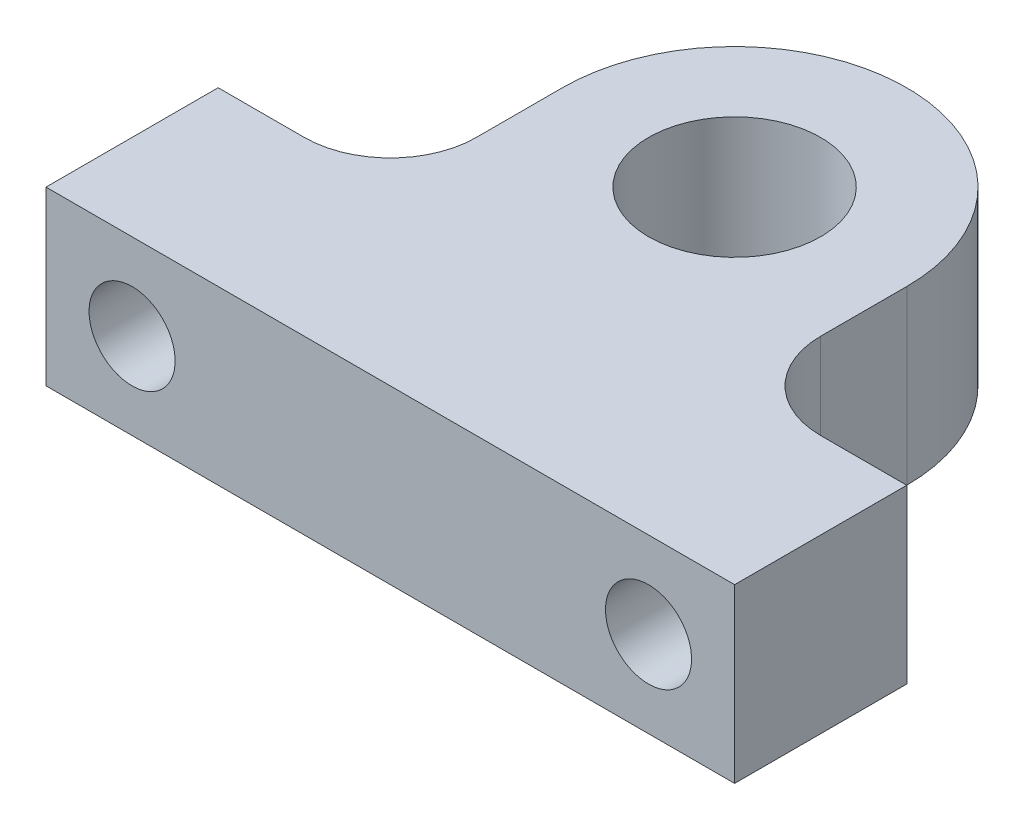
ISO-10303-21;
HEADER;
FILE_DESCRIPTION(('STEP AP214'),'2;1');
FILE_NAME('part.step','',(''),(''),'','','');
FILE_SCHEMA(('AUTOMOTIVE_DESIGN { 1 0 10303 214 1 1 1 1 }'));
ENDSEC;
DATA;
#1=APPLICATION_CONTEXT('core data for automotive mechanical design processes');
#2=APPLICATION_PROTOCOL_DEFINITION('international standard','automotive_design',2000,#1);
#3=PRODUCT_CONTEXT('',#1,'mechanical');
#4=PRODUCT('Part','Part','',(#3));
#5=PRODUCT_RELATED_PRODUCT_CATEGORY('part','',(#4));
#6=PRODUCT_DEFINITION_FORMATION('','',#4);
#7=PRODUCT_DEFINITION_CONTEXT('part definition',#1,'design');
#8=PRODUCT_DEFINITION('design','',#6,#7);
#9=PRODUCT_DEFINITION_SHAPE('','',#8);
#10=(LENGTH_UNIT() NAMED_UNIT(*) SI_UNIT(.MILLI.,.METRE.));
#11=(NAMED_UNIT(*) PLANE_ANGLE_UNIT() SI_UNIT($,.RADIAN.));
#12=(NAMED_UNIT(*) SI_UNIT($,.STERADIAN.) SOLID_ANGLE_UNIT());
#13=UNCERTAINTY_MEASURE_WITH_UNIT(LENGTH_MEASURE(1.E-05),#10,'distance_accuracy_value','');
#14=(GEOMETRIC_REPRESENTATION_CONTEXT(3) GLOBAL_UNCERTAINTY_ASSIGNED_CONTEXT((#13)) GLOBAL_UNIT_ASSIGNED_CONTEXT((#10,
#11,#12)) REPRESENTATION_CONTEXT('',''));
#15=CARTESIAN_POINT('',(0.,0.,0.));
#16=DIRECTION('',(0.,0.,1.));
#17=DIRECTION('',(1.,0.,0.));
#18=AXIS2_PLACEMENT_3D('',#15,#16,#17);
#19=CARTESIAN_POINT('',(0.,12.7,0.));
#20=DIRECTION('',(0.,1.,0.));
#21=DIRECTION('',(0.,0.,1.));
#22=AXIS2_PLACEMENT_3D('',#19,#20,#21);
#23=PLANE('',#22);
#24=CARTESIAN_POINT('',(0.,12.7,0.));
#25=DIRECTION('',(0.,1.,0.));
#26=DIRECTION('',(0.,0.,1.));
#27=AXIS2_PLACEMENT_3D('',#24,#25,#26);
#28=CIRCLE('',#27,12.7);
#29=CARTESIAN_POINT('',(12.7,12.7,0.));
#30=VERTEX_POINT('',#29);
#31=CARTESIAN_POINT('',(-12.7,12.7,0.));
#32=VERTEX_POINT('',#31);
#33=EDGE_CURVE('E240',#30,#32,#28,.T.);
#34=ORIENTED_EDGE('',*,*,#33,.T.);
#35=DIRECTION('',(0.,0.,1.));
#36=VECTOR('',#35,1.);
#37=CARTESIAN_POINT('',(-12.7,12.7,0.));
#38=LINE('',#37,#36);
#39=CARTESIAN_POINT('',(-12.7,12.7,6.35));
#40=VERTEX_POINT('',#39);
#41=EDGE_CURVE('E233',#32,#40,#38,.T.);
#42=ORIENTED_EDGE('',*,*,#41,.T.);
#43=CARTESIAN_POINT('',(-19.05,12.7,6.35));
#44=DIRECTION('',(0.,1.,0.));
#45=DIRECTION('',(0.,0.,1.));
#46=AXIS2_PLACEMENT_3D('',#43,#44,#45);
#47=CIRCLE('',#46,6.35);
#48=CARTESIAN_POINT('',(-19.05,12.7,12.7));
#49=VERTEX_POINT('',#48);
#50=EDGE_CURVE('E155',#40,#49,#47,.F.);
#51=ORIENTED_EDGE('',*,*,#50,.T.);
#52=DIRECTION('',(-1.,0.,0.));
#53=VECTOR('',#52,1.);
#54=CARTESIAN_POINT('',(-12.7,12.7,12.7));
#55=LINE('',#54,#53);
#56=CARTESIAN_POINT('',(-25.4,12.7,12.7));
#57=VERTEX_POINT('',#56);
#58=EDGE_CURVE('E242',#49,#57,#55,.T.);
#59=ORIENTED_EDGE('',*,*,#58,.T.);
#60=DIRECTION('',(0.,0.,1.));
#61=VECTOR('',#60,1.);
#62=CARTESIAN_POINT('',(-25.4,12.7,12.7));
#63=LINE('',#62,#61);
#64=CARTESIAN_POINT('',(-25.4,12.7,25.4));
#65=VERTEX_POINT('',#64);
#66=EDGE_CURVE('E247',#57,#65,#63,.T.);
#67=ORIENTED_EDGE('',*,*,#66,.T.);
#68=DIRECTION('',(1.,0.,0.));
#69=VECTOR('',#68,1.);
#70=CARTESIAN_POINT('',(-25.4,12.7,25.4));
#71=LINE('',#70,#69);
#72=CARTESIAN_POINT('',(25.4,12.7,25.4));
#73=VERTEX_POINT('',#72);
#74=EDGE_CURVE('E249',#65,#73,#71,.T.);
#75=ORIENTED_EDGE('',*,*,#74,.T.);
#76=DIRECTION('',(0.,0.,-1.));
#77=VECTOR('',#76,1.);
#78=CARTESIAN_POINT('',(25.4,12.7,25.4));
#79=LINE('',#78,#77);
#80=CARTESIAN_POINT('',(25.4,12.7,12.7));
#81=VERTEX_POINT('',#80);
#82=EDGE_CURVE('E254',#73,#81,#79,.T.);
#83=ORIENTED_EDGE('',*,*,#82,.T.);
#84=DIRECTION('',(-1.,0.,0.));
#85=VECTOR('',#84,1.);
#86=CARTESIAN_POINT('',(12.7,12.7,12.7));
#87=LINE('',#86,#85);
#88=CARTESIAN_POINT('',(19.05,12.7,12.7));
#89=VERTEX_POINT('',#88);
#90=EDGE_CURVE('E256',#81,#89,#87,.T.);
#91=ORIENTED_EDGE('',*,*,#90,.T.);
#92=CARTESIAN_POINT('',(19.05,12.7,6.35));
#93=DIRECTION('',(0.,1.,0.));
#94=DIRECTION('',(0.,0.,1.));
#95=AXIS2_PLACEMENT_3D('',#92,#93,#94);
#96=CIRCLE('',#95,6.35);
#97=CARTESIAN_POINT('',(12.7,12.7,6.35));
#98=VERTEX_POINT('',#97);
#99=EDGE_CURVE('E134',#89,#98,#96,.F.);
#100=ORIENTED_EDGE('',*,*,#99,.T.);
#101=DIRECTION('',(0.,0.,-1.));
#102=VECTOR('',#101,1.);
#103=CARTESIAN_POINT('',(12.7,12.7,0.));
#104=LINE('',#103,#102);
#105=EDGE_CURVE('E258',#98,#30,#104,.T.);
#106=ORIENTED_EDGE('',*,*,#105,.T.);
#107=EDGE_LOOP('',(#34,#42,#51,#59,#67,#75,#83,#91,#100,#106));
#108=FACE_BOUND('',#107,.T.);
#109=CARTESIAN_POINT('',(0.,12.7,0.));
#110=DIRECTION('',(0.,1.,0.));
#111=DIRECTION('',(0.,0.,1.));
#112=AXIS2_PLACEMENT_3D('',#109,#110,#111);
#113=CIRCLE('',#112,6.35);
#114=CARTESIAN_POINT('',(0.,12.7,6.35));
#115=VERTEX_POINT('',#114);
#116=EDGE_CURVE('E264',#115,#115,#113,.T.);
#117=ORIENTED_EDGE('',*,*,#116,.F.);
#118=EDGE_LOOP('',(#117));
#119=FACE_BOUND('',#118,.T.);
#120=ADVANCED_FACE('F38',(#108,#119),#23,.T.);
#121=CARTESIAN_POINT('',(0.,0.,0.));
#122=DIRECTION('',(0.,1.,0.));
#123=DIRECTION('',(0.,0.,1.));
#124=AXIS2_PLACEMENT_3D('',#121,#122,#123);
#125=PLANE('',#124);
#126=CARTESIAN_POINT('',(0.,0.,0.));
#127=DIRECTION('',(0.,1.,0.));
#128=DIRECTION('',(0.,0.,1.));
#129=AXIS2_PLACEMENT_3D('',#126,#127,#128);
#130=CIRCLE('',#129,12.7);
#131=CARTESIAN_POINT('',(12.7,0.,0.));
#132=VERTEX_POINT('',#131);
#133=CARTESIAN_POINT('',(-12.7,0.,0.));
#134=VERTEX_POINT('',#133);
#135=EDGE_CURVE('E261',#132,#134,#130,.T.);
#136=ORIENTED_EDGE('',*,*,#135,.F.);
#137=DIRECTION('',(0.,0.,-1.));
#138=VECTOR('',#137,1.);
#139=CARTESIAN_POINT('',(12.7,0.,0.));
#140=LINE('',#139,#138);
#141=CARTESIAN_POINT('',(12.7,0.,6.35));
#142=VERTEX_POINT('',#141);
#143=EDGE_CURVE('E276',#142,#132,#140,.T.);
#144=ORIENTED_EDGE('',*,*,#143,.F.);
#145=CARTESIAN_POINT('',(19.05,0.,6.35));
#146=DIRECTION('',(0.,1.,0.));
#147=DIRECTION('',(0.,0.,1.));
#148=AXIS2_PLACEMENT_3D('',#145,#146,#147);
#149=CIRCLE('',#148,6.35);
#150=CARTESIAN_POINT('',(19.05,0.,12.7));
#151=VERTEX_POINT('',#150);
#152=EDGE_CURVE('E157',#142,#151,#149,.T.);
#153=ORIENTED_EDGE('',*,*,#152,.T.);
#154=DIRECTION('',(-1.,0.,0.));
#155=VECTOR('',#154,1.);
#156=CARTESIAN_POINT('',(12.7,0.,12.7));
#157=LINE('',#156,#155);
#158=CARTESIAN_POINT('',(25.4,0.,12.7));
#159=VERTEX_POINT('',#158);
#160=EDGE_CURVE('E274',#159,#151,#157,.T.);
#161=ORIENTED_EDGE('',*,*,#160,.F.);
#162=DIRECTION('',(0.,0.,-1.));
#163=VECTOR('',#162,1.);
#164=CARTESIAN_POINT('',(25.4,0.,25.4));
#165=LINE('',#164,#163);
#166=CARTESIAN_POINT('',(25.4,0.,25.4));
#167=VERTEX_POINT('',#166);
#168=EDGE_CURVE('E272',#167,#159,#165,.T.);
#169=ORIENTED_EDGE('',*,*,#168,.F.);
#170=DIRECTION('',(1.,0.,0.));
#171=VECTOR('',#170,1.);
#172=CARTESIAN_POINT('',(-25.4,0.,25.4));
#173=LINE('',#172,#171);
#174=CARTESIAN_POINT('',(-25.4,0.,25.4));
#175=VERTEX_POINT('',#174);
#176=EDGE_CURVE('E270',#175,#167,#173,.T.);
#177=ORIENTED_EDGE('',*,*,#176,.F.);
#178=DIRECTION('',(0.,0.,1.));
#179=VECTOR('',#178,1.);
#180=CARTESIAN_POINT('',(-25.4,0.,12.7));
#181=LINE('',#180,#179);
#182=CARTESIAN_POINT('',(-25.4,0.,12.7));
#183=VERTEX_POINT('',#182);
#184=EDGE_CURVE('E268',#183,#175,#181,.T.);
#185=ORIENTED_EDGE('',*,*,#184,.F.);
#186=DIRECTION('',(-1.,0.,0.));
#187=VECTOR('',#186,1.);
#188=CARTESIAN_POINT('',(-12.7,0.,12.7));
#189=LINE('',#188,#187);
#190=CARTESIAN_POINT('',(-19.05,0.,12.7));
#191=VERTEX_POINT('',#190);
#192=EDGE_CURVE('E266',#191,#183,#189,.T.);
#193=ORIENTED_EDGE('',*,*,#192,.F.);
#194=CARTESIAN_POINT('',(-19.05,0.,6.35));
#195=DIRECTION('',(0.,1.,0.));
#196=DIRECTION('',(0.,0.,1.));
#197=AXIS2_PLACEMENT_3D('',#194,#195,#196);
#198=CIRCLE('',#197,6.35);
#199=CARTESIAN_POINT('',(-12.7,0.,6.35));
#200=VERTEX_POINT('',#199);
#201=EDGE_CURVE('E148',#191,#200,#198,.T.);
#202=ORIENTED_EDGE('',*,*,#201,.T.);
#203=DIRECTION('',(0.,0.,1.));
#204=VECTOR('',#203,1.);
#205=CARTESIAN_POINT('',(-12.7,0.,0.));
#206=LINE('',#205,#204);
#207=EDGE_CURVE('E235',#134,#200,#206,.T.);
#208=ORIENTED_EDGE('',*,*,#207,.F.);
#209=EDGE_LOOP('',(#136,#144,#153,#161,#169,#177,#185,#193,#202,#208));
#210=FACE_BOUND('',#209,.T.);
#211=CARTESIAN_POINT('',(0.,0.,0.));
#212=DIRECTION('',(0.,1.,0.));
#213=DIRECTION('',(0.,0.,1.));
#214=AXIS2_PLACEMENT_3D('',#211,#212,#213);
#215=CIRCLE('',#214,6.35);
#216=CARTESIAN_POINT('',(0.,0.,6.35));
#217=VERTEX_POINT('',#216);
#218=EDGE_CURVE('E304',#217,#217,#215,.T.);
#219=ORIENTED_EDGE('',*,*,#218,.T.);
#220=EDGE_LOOP('',(#219));
#221=FACE_BOUND('',#220,.T.);
#222=ADVANCED_FACE('F178',(#210,#221),#125,.F.);
#223=CARTESIAN_POINT('',(0.,12.7,0.));
#224=DIRECTION('',(0.,-1.,0.));
#225=DIRECTION('',(0.,0.,-1.));
#226=AXIS2_PLACEMENT_3D('',#223,#224,#225);
#227=CYLINDRICAL_SURFACE('',#226,12.7);
#228=ORIENTED_EDGE('',*,*,#135,.T.);
#229=DIRECTION('',(0.,-1.,0.));
#230=VECTOR('',#229,1.);
#231=CARTESIAN_POINT('',(-12.7,12.7,0.));
#232=LINE('',#231,#230);
#233=EDGE_CURVE('E225',#32,#134,#232,.T.);
#234=ORIENTED_EDGE('',*,*,#233,.F.);
#235=ORIENTED_EDGE('',*,*,#33,.F.);
#236=DIRECTION('',(0.,-1.,0.));
#237=VECTOR('',#236,1.);
#238=CARTESIAN_POINT('',(12.7,12.7,0.));
#239=LINE('',#238,#237);
#240=EDGE_CURVE('E260',#30,#132,#239,.T.);
#241=ORIENTED_EDGE('',*,*,#240,.T.);
#242=EDGE_LOOP('',(#228,#234,#235,#241));
#243=FACE_BOUND('',#242,.T.);
#244=ADVANCED_FACE('F182',(#243),#227,.T.);
#245=CARTESIAN_POINT('',(-12.7,12.7,0.));
#246=DIRECTION('',(1.,0.,0.));
#247=DIRECTION('',(0.,0.,-1.));
#248=AXIS2_PLACEMENT_3D('',#245,#246,#247);
#249=PLANE('',#248);
#250=ORIENTED_EDGE('',*,*,#207,.T.);
#251=DIRECTION('',(0.,-1.,0.));
#252=VECTOR('',#251,1.);
#253=CARTESIAN_POINT('',(-12.7,12.7,6.35));
#254=LINE('',#253,#252);
#255=EDGE_CURVE('E150',#200,#40,#254,.F.);
#256=ORIENTED_EDGE('',*,*,#255,.T.);
#257=ORIENTED_EDGE('',*,*,#41,.F.);
#258=ORIENTED_EDGE('',*,*,#233,.T.);
#259=EDGE_LOOP('',(#250,#256,#257,#258));
#260=FACE_BOUND('',#259,.T.);
#261=ADVANCED_FACE('F204',(#260),#249,.F.);
#262=CARTESIAN_POINT('',(-12.7,12.7,12.7));
#263=DIRECTION('',(0.,0.,1.));
#264=DIRECTION('',(1.,0.,0.));
#265=AXIS2_PLACEMENT_3D('',#262,#263,#264);
#266=PLANE('',#265);
#267=DIRECTION('',(0.,-1.,0.));
#268=VECTOR('',#267,1.);
#269=CARTESIAN_POINT('',(-19.05,0.,12.7));
#270=LINE('',#269,#268);
#271=CARTESIAN_POINT('',(-19.05,9.525,12.7));
#272=VERTEX_POINT('',#271);
#273=EDGE_CURVE('E224',#49,#272,#270,.T.);
#274=ORIENTED_EDGE('',*,*,#273,.T.);
#275=CARTESIAN_POINT('',(-19.05,6.35,12.7));
#276=DIRECTION('',(0.,0.,1.));
#277=DIRECTION('',(1.,0.,0.));
#278=AXIS2_PLACEMENT_3D('',#275,#276,#277);
#279=CIRCLE('',#278,3.175);
#280=CARTESIAN_POINT('',(-19.05,3.175,12.7));
#281=VERTEX_POINT('',#280);
#282=EDGE_CURVE('E58',#272,#281,#279,.T.);
#283=ORIENTED_EDGE('',*,*,#282,.T.);
#284=EDGE_CURVE('E219',#281,#191,#270,.T.);
#285=ORIENTED_EDGE('',*,*,#284,.T.);
#286=ORIENTED_EDGE('',*,*,#192,.T.);
#287=DIRECTION('',(0.,-1.,0.));
#288=VECTOR('',#287,1.);
#289=CARTESIAN_POINT('',(-25.4,12.7,12.7));
#290=LINE('',#289,#288);
#291=EDGE_CURVE('E228',#57,#183,#290,.T.);
#292=ORIENTED_EDGE('',*,*,#291,.F.);
#293=ORIENTED_EDGE('',*,*,#58,.F.);
#294=EDGE_LOOP('',(#274,#283,#285,#286,#292,#293));
#295=FACE_BOUND('',#294,.T.);
#296=ADVANCED_FACE('F200',(#295),#266,.F.);
#297=CARTESIAN_POINT('',(-25.4,12.7,12.7));
#298=DIRECTION('',(1.,0.,0.));
#299=DIRECTION('',(0.,0.,-1.));
#300=AXIS2_PLACEMENT_3D('',#297,#298,#299);
#301=PLANE('',#300);
#302=ORIENTED_EDGE('',*,*,#184,.T.);
#303=DIRECTION('',(0.,-1.,0.));
#304=VECTOR('',#303,1.);
#305=CARTESIAN_POINT('',(-25.4,12.7,25.4));
#306=LINE('',#305,#304);
#307=EDGE_CURVE('E286',#65,#175,#306,.T.);
#308=ORIENTED_EDGE('',*,*,#307,.F.);
#309=ORIENTED_EDGE('',*,*,#66,.F.);
#310=ORIENTED_EDGE('',*,*,#291,.T.);
#311=EDGE_LOOP('',(#302,#308,#309,#310));
#312=FACE_BOUND('',#311,.T.);
#313=ADVANCED_FACE('F196',(#312),#301,.F.);
#314=CARTESIAN_POINT('',(-25.4,12.7,25.4));
#315=DIRECTION('',(0.,0.,-1.));
#316=DIRECTION('',(-1.,0.,0.));
#317=AXIS2_PLACEMENT_3D('',#314,#315,#316);
#318=PLANE('',#317);
#319=CARTESIAN_POINT('',(-19.05,6.35,25.4));
#320=DIRECTION('',(0.,0.,-1.));
#321=DIRECTION('',(-1.,0.,0.));
#322=AXIS2_PLACEMENT_3D('',#319,#320,#321);
#323=CIRCLE('',#322,3.175);
#324=CARTESIAN_POINT('',(-22.225,6.35,25.4));
#325=VERTEX_POINT('',#324);
#326=EDGE_CURVE('E142',#325,#325,#323,.T.);
#327=ORIENTED_EDGE('',*,*,#326,.T.);
#328=EDGE_LOOP('',(#327));
#329=FACE_BOUND('',#328,.T.);
#330=CARTESIAN_POINT('',(19.05,6.35,25.4));
#331=DIRECTION('',(0.,0.,-1.));
#332=DIRECTION('',(-1.,0.,0.));
#333=AXIS2_PLACEMENT_3D('',#330,#331,#332);
#334=CIRCLE('',#333,3.175);
#335=CARTESIAN_POINT('',(15.875,6.35,25.4));
#336=VERTEX_POINT('',#335);
#337=EDGE_CURVE('E310',#336,#336,#334,.T.);
#338=ORIENTED_EDGE('',*,*,#337,.T.);
#339=EDGE_LOOP('',(#338));
#340=FACE_BOUND('',#339,.T.);
#341=ORIENTED_EDGE('',*,*,#176,.T.);
#342=DIRECTION('',(0.,-1.,0.));
#343=VECTOR('',#342,1.);
#344=CARTESIAN_POINT('',(25.4,12.7,25.4));
#345=LINE('',#344,#343);
#346=EDGE_CURVE('E283',#73,#167,#345,.T.);
#347=ORIENTED_EDGE('',*,*,#346,.F.);
#348=ORIENTED_EDGE('',*,*,#74,.F.);
#349=ORIENTED_EDGE('',*,*,#307,.T.);
#350=EDGE_LOOP('',(#341,#347,#348,#349));
#351=FACE_BOUND('',#350,.T.);
#352=ADVANCED_FACE('F192',(#329,#340,#351),#318,.F.);
#353=CARTESIAN_POINT('',(25.4,12.7,25.4));
#354=DIRECTION('',(-1.,0.,0.));
#355=DIRECTION('',(0.,0.,1.));
#356=AXIS2_PLACEMENT_3D('',#353,#354,#355);
#357=PLANE('',#356);
#358=ORIENTED_EDGE('',*,*,#168,.T.);
#359=DIRECTION('',(0.,-1.,0.));
#360=VECTOR('',#359,1.);
#361=CARTESIAN_POINT('',(25.4,12.7,12.7));
#362=LINE('',#361,#360);
#363=EDGE_CURVE('E280',#81,#159,#362,.T.);
#364=ORIENTED_EDGE('',*,*,#363,.F.);
#365=ORIENTED_EDGE('',*,*,#82,.F.);
#366=ORIENTED_EDGE('',*,*,#346,.T.);
#367=EDGE_LOOP('',(#358,#364,#365,#366));
#368=FACE_BOUND('',#367,.T.);
#369=ADVANCED_FACE('F189',(#368),#357,.F.);
#370=CARTESIAN_POINT('',(12.7,12.7,12.7));
#371=DIRECTION('',(0.,0.,1.));
#372=DIRECTION('',(1.,0.,0.));
#373=AXIS2_PLACEMENT_3D('',#370,#371,#372);
#374=PLANE('',#373);
#375=DIRECTION('',(0.,-1.,0.));
#376=VECTOR('',#375,1.);
#377=CARTESIAN_POINT('',(19.05,12.7,12.7));
#378=LINE('',#377,#376);
#379=CARTESIAN_POINT('',(19.05,3.175,12.7));
#380=VERTEX_POINT('',#379);
#381=EDGE_CURVE('E141',#151,#380,#378,.F.);
#382=ORIENTED_EDGE('',*,*,#381,.T.);
#383=CARTESIAN_POINT('',(19.05,6.35,12.7));
#384=DIRECTION('',(0.,0.,1.));
#385=DIRECTION('',(1.,0.,0.));
#386=AXIS2_PLACEMENT_3D('',#383,#384,#385);
#387=CIRCLE('',#386,3.175);
#388=CARTESIAN_POINT('',(19.05,9.525,12.7));
#389=VERTEX_POINT('',#388);
#390=EDGE_CURVE('E64',#380,#389,#387,.T.);
#391=ORIENTED_EDGE('',*,*,#390,.T.);
#392=EDGE_CURVE('E138',#389,#89,#378,.F.);
#393=ORIENTED_EDGE('',*,*,#392,.T.);
#394=ORIENTED_EDGE('',*,*,#90,.F.);
#395=ORIENTED_EDGE('',*,*,#363,.T.);
#396=ORIENTED_EDGE('',*,*,#160,.T.);
#397=EDGE_LOOP('',(#382,#391,#393,#394,#395,#396));
#398=FACE_BOUND('',#397,.T.);
#399=ADVANCED_FACE('F136',(#398),#374,.F.);
#400=CARTESIAN_POINT('',(12.7,12.7,0.));
#401=DIRECTION('',(-1.,0.,0.));
#402=DIRECTION('',(0.,0.,1.));
#403=AXIS2_PLACEMENT_3D('',#400,#401,#402);
#404=PLANE('',#403);
#405=ORIENTED_EDGE('',*,*,#105,.F.);
#406=DIRECTION('',(0.,-1.,0.));
#407=VECTOR('',#406,1.);
#408=CARTESIAN_POINT('',(12.7,0.,6.35));
#409=LINE('',#408,#407);
#410=EDGE_CURVE('E146',#98,#142,#409,.T.);
#411=ORIENTED_EDGE('',*,*,#410,.T.);
#412=ORIENTED_EDGE('',*,*,#143,.T.);
#413=ORIENTED_EDGE('',*,*,#240,.F.);
#414=EDGE_LOOP('',(#405,#411,#412,#413));
#415=FACE_BOUND('',#414,.T.);
#416=ADVANCED_FACE('F174',(#415),#404,.F.);
#417=CARTESIAN_POINT('',(0.,12.7,0.));
#418=DIRECTION('',(0.,-1.,0.));
#419=DIRECTION('',(0.,0.,-1.));
#420=AXIS2_PLACEMENT_3D('',#417,#418,#419);
#421=CYLINDRICAL_SURFACE('',#420,6.35);
#422=ORIENTED_EDGE('',*,*,#116,.T.);
#423=EDGE_LOOP('',(#422));
#424=FACE_BOUND('',#423,.T.);
#425=ORIENTED_EDGE('',*,*,#218,.F.);
#426=EDGE_LOOP('',(#425));
#427=FACE_BOUND('',#426,.T.);
#428=ADVANCED_FACE('F170',(#424,#427),#421,.F.);
#429=CARTESIAN_POINT('',(-19.05,12.7,6.35));
#430=DIRECTION('',(0.,1.,0.));
#431=DIRECTION('',(0.,0.,1.));
#432=AXIS2_PLACEMENT_3D('',#429,#430,#431);
#433=CYLINDRICAL_SURFACE('',#432,6.35);
#434=ORIENTED_EDGE('',*,*,#284,.F.);
#435=CARTESIAN_POINT('',(-19.05,3.175,12.7));
#436=CARTESIAN_POINT('',(-18.9661868641069,3.17498653579622,12.7000148768352));
#437=CARTESIAN_POINT('',(-18.8823832679772,3.17831834977993,12.6983410309855));
#438=CARTESIAN_POINT('',(-18.7154607991599,3.19156795153758,12.6917275054846));
#439=CARTESIAN_POINT('',(-18.6323416650645,3.20148309449872,12.686789137339));
#440=CARTESIAN_POINT('',(-18.4677576031168,3.22773556369882,12.6737874125387));
#441=CARTESIAN_POINT('',(-18.3862869034774,3.24404371004189,12.6657382569284));
#442=CARTESIAN_POINT('',(-18.2252078657657,3.28288151484062,12.6467298671048));
#443=CARTESIAN_POINT('',(-18.1455996433839,3.30541155867184,12.6357704526358));
#444=CARTESIAN_POINT('',(-17.910563274253,3.38194102132547,12.5989372146223));
#445=CARTESIAN_POINT('',(-17.7585776987776,3.44493594710843,12.5690794331309));
#446=CARTESIAN_POINT('',(-17.4674756130362,3.59265020368409,12.5014674677271));
#447=CARTESIAN_POINT('',(-17.3283721540936,3.67739124551991,12.4637053992614));
#448=CARTESIAN_POINT('',(-17.0576616892692,3.87197317628583,12.3811091750018));
#449=CARTESIAN_POINT('',(-16.9270047580365,3.98301468885738,12.3359866883754));
#450=CARTESIAN_POINT('',(-16.6853150725581,4.22441068472524,12.2447004442819));
#451=CARTESIAN_POINT('',(-16.5742952168888,4.35477775942188,12.1985360247024));
#452=CARTESIAN_POINT('',(-16.3663110267842,4.6434225909269,12.1062358154767));
#453=CARTESIAN_POINT('',(-16.2711065206981,4.80308132093258,12.0603803730753));
#454=CARTESIAN_POINT('',(-16.1498041772782,5.05455311507872,11.9991964283448));
#455=CARTESIAN_POINT('',(-16.1129456364181,5.14040423632504,11.9800633255986));
#456=CARTESIAN_POINT('',(-16.0467742220338,5.31558777381157,11.9450456646422));
#457=CARTESIAN_POINT('',(-16.0174568883146,5.40491809613474,11.9291591873857));
#458=CARTESIAN_POINT('',(-15.9682576343467,5.58100957918072,11.9021262655896));
#459=CARTESIAN_POINT('',(-15.9479191817021,5.66760881852995,11.8907545507082));
#460=CARTESIAN_POINT('',(-15.9145446745264,5.84258327304373,11.8719369328456));
#461=CARTESIAN_POINT('',(-15.9015047462852,5.9309575202674,11.8644889474587));
#462=CARTESIAN_POINT('',(-15.8829232278836,6.1087016626109,11.853838964793));
#463=CARTESIAN_POINT('',(-15.8773772914046,6.1980709502809,11.8506345064014));
#464=CARTESIAN_POINT('',(-15.8738521646991,6.37697874585526,11.8485978572122));
#465=CARTESIAN_POINT('',(-15.8758722526135,6.46651723680162,11.8497652493052));
#466=CARTESIAN_POINT('',(-15.8918808155178,6.71274957786407,11.8589919686343));
#467=CARTESIAN_POINT('',(-15.9137879819315,6.86884512461093,11.8716088534605));
#468=CARTESIAN_POINT('',(-15.9799634560278,7.17464987995123,11.908665455198));
#469=CARTESIAN_POINT('',(-16.024238403357,7.32435717794045,11.9331086825466));
#470=CARTESIAN_POINT('',(-16.1346842829461,7.61754228999048,11.9915784599863));
#471=CARTESIAN_POINT('',(-16.2013411545281,7.7607938161009,12.0258149460602));
#472=CARTESIAN_POINT('',(-16.3542894179655,8.03476230287298,12.1000315277387));
#473=CARTESIAN_POINT('',(-16.4405901692385,8.16547324617916,12.1400143578577));
#474=CARTESIAN_POINT('',(-16.6431394979668,8.42810069886452,12.2273416962742));
#475=CARTESIAN_POINT('',(-16.7617974657701,8.55807017377976,12.2749769597347));
#476=CARTESIAN_POINT('',(-17.019392743561,8.79707558515151,12.3681332727318));
#477=CARTESIAN_POINT('',(-17.1583409319938,8.90610021912695,12.4136531707644));
#478=CARTESIAN_POINT('',(-17.4609764455085,9.1049644636108,12.5000640786015));
#479=CARTESIAN_POINT('',(-17.6255188149455,9.19366345244255,12.5406375551501));
#480=CARTESIAN_POINT('',(-17.8833644385566,9.30438017751755,12.5925315830538));
#481=CARTESIAN_POINT('',(-17.9711288296296,9.33755840281637,12.6083324568528));
#482=CARTESIAN_POINT('',(-18.1497304165421,9.39613879570133,12.6365071948512));
#483=CARTESIAN_POINT('',(-18.2405664306542,9.42154391682609,12.6488823605428));
#484=CARTESIAN_POINT('',(-18.4495606484314,9.47001530281448,12.6726419447297));
#485=CARTESIAN_POINT('',(-18.5684523903165,9.49058218992912,12.68284913601));
#486=CARTESIAN_POINT('',(-18.7482151221185,9.51120299795092,12.6931103900185));
#487=CARTESIAN_POINT('',(-18.808408301172,9.5163717042814,12.6956892467655));
#488=CARTESIAN_POINT('',(-18.9290613384442,9.52327116714734,12.6991353577713));
#489=CARTESIAN_POINT('',(-18.9895212831722,9.52500071140332,12.7000020084894));
#490=CARTESIAN_POINT('',(-19.05,9.525,12.7));
#491=B_SPLINE_CURVE_WITH_KNOTS('',3,(#435,#436,#437,#438,#439,#440,#441,#442,#443,#444,#445,
#446,#447,#448,#449,#450,#451,#452,#453,#454,#455,#456,#457,#458,#459,#460,#461,#462,#463,#464,
#465,#466,#467,#468,#469,#470,#471,#472,#473,#474,#475,#476,#477,#478,#479,#480,#481,#482,#483,
#484,#485,#486,#487,#488,#489,#490),.UNSPECIFIED.,.F.,.F.,(4,2,2,2,2,2,2,2,2,2,2,2,2,2,2,2,2,2,
2,2,2,2,2,2,2,2,2,4),(0.,0.25134064245638,0.502580371369121,0.752686462215378,1.00280804775646,
1.5020101843342,2.00171267021975,2.53138728506782,3.06140853403427,3.63256934148912,
3.91833589745098,4.20393304810651,4.47258918308846,4.74110259261351,5.00946020446801,
5.27779221351351,5.74974058996722,6.22182914184532,6.70491257972051,7.18822666852088,
7.73279923072409,8.27766484063192,8.84810377097813,9.13318372784543,9.41815522825881,
9.78034993987073,9.96165428807349,10.1430225334118),.UNSPECIFIED.);
#492=EDGE_CURVE('E11',#281,#272,#491,.T.);
#493=ORIENTED_EDGE('',*,*,#492,.T.);
#494=ORIENTED_EDGE('',*,*,#273,.F.);
#495=ORIENTED_EDGE('',*,*,#50,.F.);
#496=ORIENTED_EDGE('',*,*,#255,.F.);
#497=ORIENTED_EDGE('',*,*,#201,.F.);
#498=EDGE_LOOP('',(#434,#493,#494,#495,#496,#497));
#499=FACE_BOUND('',#498,.T.);
#500=ADVANCED_FACE('F173',(#499),#433,.F.);
#501=CARTESIAN_POINT('',(19.05,12.7,6.35));
#502=DIRECTION('',(0.,1.,0.));
#503=DIRECTION('',(0.,0.,1.));
#504=AXIS2_PLACEMENT_3D('',#501,#502,#503);
#505=CYLINDRICAL_SURFACE('',#504,6.35);
#506=ORIENTED_EDGE('',*,*,#392,.F.);
#507=CARTESIAN_POINT('',(19.05,9.525,12.7));
#508=CARTESIAN_POINT('',(18.9661868641069,9.52501346420378,12.7000148768352));
#509=CARTESIAN_POINT('',(18.8823832679772,9.52168165022008,12.6983410309855));
#510=CARTESIAN_POINT('',(18.7154607991599,9.50843204846243,12.6917275054846));
#511=CARTESIAN_POINT('',(18.6323416650645,9.49851690550128,12.686789137339));
#512=CARTESIAN_POINT('',(18.4677576031168,9.47226443630119,12.6737874125387));
#513=CARTESIAN_POINT('',(18.3862869034774,9.45595628995811,12.6657382569284));
#514=CARTESIAN_POINT('',(18.2252078657657,9.41711848515939,12.6467298671048));
#515=CARTESIAN_POINT('',(18.1455996433839,9.39458844132816,12.6357704526358));
#516=CARTESIAN_POINT('',(17.910563274253,9.31805897867453,12.5989372146223));
#517=CARTESIAN_POINT('',(17.7585776987776,9.25506405289158,12.5690794331309));
#518=CARTESIAN_POINT('',(17.4674756130362,9.10734979631591,12.5014674677271));
#519=CARTESIAN_POINT('',(17.3283721540936,9.02260875448009,12.4637053992614));
#520=CARTESIAN_POINT('',(17.0576616892692,8.82802682371417,12.3811091750018));
#521=CARTESIAN_POINT('',(16.9270047580365,8.71698531114262,12.3359866883754));
#522=CARTESIAN_POINT('',(16.6853150725581,8.47558931527476,12.2447004442819));
#523=CARTESIAN_POINT('',(16.5742952168888,8.34522224057812,12.1985360247024));
#524=CARTESIAN_POINT('',(16.3663110267842,8.0565774090731,12.1062358154767));
#525=CARTESIAN_POINT('',(16.2711065206981,7.89691867906743,12.0603803730753));
#526=CARTESIAN_POINT('',(16.1498041772782,7.64544688492128,11.9991964283448));
#527=CARTESIAN_POINT('',(16.1129456364181,7.55959576367496,11.9800633255985));
#528=CARTESIAN_POINT('',(16.0467742220338,7.38441222618843,11.9450456646422));
#529=CARTESIAN_POINT('',(16.0174568883146,7.29508190386526,11.9291591873857));
#530=CARTESIAN_POINT('',(15.9682576343467,7.11899042081929,11.9021262655896));
#531=CARTESIAN_POINT('',(15.9479191817021,7.03239118147005,11.8907545507082));
#532=CARTESIAN_POINT('',(15.9145446745264,6.85741672695628,11.8719369328456));
#533=CARTESIAN_POINT('',(15.9015047462852,6.76904247973261,11.8644889474587));
#534=CARTESIAN_POINT('',(15.8829232278836,6.5912983373891,11.853838964793));
#535=CARTESIAN_POINT('',(15.8773772914046,6.5019290497191,11.8506345064014));
#536=CARTESIAN_POINT('',(15.8738521646991,6.32302125414474,11.8485978572122));
#537=CARTESIAN_POINT('',(15.8758722526135,6.23348276319839,11.8497652493052));
#538=CARTESIAN_POINT('',(15.8918808155178,5.98725042213594,11.8589919686343));
#539=CARTESIAN_POINT('',(15.9137879819315,5.83115487538907,11.8716088534605));
#540=CARTESIAN_POINT('',(15.9799634560278,5.52535012004877,11.908665455198));
#541=CARTESIAN_POINT('',(16.024238403357,5.37564282205955,11.9331086825466));
#542=CARTESIAN_POINT('',(16.1346842829461,5.08245771000952,11.9915784599863));
#543=CARTESIAN_POINT('',(16.2013411545281,4.9392061838991,12.0258149460602));
#544=CARTESIAN_POINT('',(16.3542894179655,4.66523769712702,12.1000315277387));
#545=CARTESIAN_POINT('',(16.4405901692385,4.53452675382084,12.1400143578577));
#546=CARTESIAN_POINT('',(16.6431394979668,4.27189930113548,12.2273416962742));
#547=CARTESIAN_POINT('',(16.7617974657701,4.14192982622024,12.2749769597347));
#548=CARTESIAN_POINT('',(17.019392743561,3.90292441484849,12.3681332727318));
#549=CARTESIAN_POINT('',(17.1583409319938,3.79389978087305,12.4136531707644));
#550=CARTESIAN_POINT('',(17.4609764455085,3.5950355363892,12.5000640786015));
#551=CARTESIAN_POINT('',(17.6255188149455,3.50633654755745,12.5406375551501));
#552=CARTESIAN_POINT('',(17.8833644385566,3.39561982248246,12.5925315830538));
#553=CARTESIAN_POINT('',(17.9711288296296,3.36244159718363,12.6083324568528));
#554=CARTESIAN_POINT('',(18.1497304165421,3.30386120429867,12.6365071948512));
#555=CARTESIAN_POINT('',(18.2405664306542,3.27845608317392,12.6488823605428));
#556=CARTESIAN_POINT('',(18.4495606484314,3.22998469718552,12.6726419447297));
#557=CARTESIAN_POINT('',(18.5684523903165,3.20941781007088,12.68284913601));
#558=CARTESIAN_POINT('',(18.7482151221185,3.18879700204909,12.6931103900185));
#559=CARTESIAN_POINT('',(18.808408301172,3.1836282957186,12.6956892467655));
#560=CARTESIAN_POINT('',(18.9290613384442,3.17672883285267,12.6991353577713));
#561=CARTESIAN_POINT('',(18.9895212831722,3.17499928859668,12.7000020084894));
#562=CARTESIAN_POINT('',(19.05,3.175,12.7));
#563=B_SPLINE_CURVE_WITH_KNOTS('',3,(#507,#508,#509,#510,#511,#512,#513,#514,#515,#516,#517,
#518,#519,#520,#521,#522,#523,#524,#525,#526,#527,#528,#529,#530,#531,#532,#533,#534,#535,#536,
#537,#538,#539,#540,#541,#542,#543,#544,#545,#546,#547,#548,#549,#550,#551,#552,#553,#554,#555,
#556,#557,#558,#559,#560,#561,#562),.UNSPECIFIED.,.F.,.F.,(4,2,2,2,2,2,2,2,2,2,2,2,2,2,2,2,2,2,
2,2,2,2,2,2,2,2,2,4),(0.,0.25134064245638,0.502580371369121,0.752686462215378,1.00280804775646,
1.5020101843342,2.00171267021975,2.53138728506782,3.06140853403427,3.63256934148912,
3.91833589745097,4.20393304810651,4.47258918308846,4.74110259261351,5.009460204468,
5.27779221351351,5.74974058996722,6.22182914184533,6.70491257972052,7.18822666852088,
7.73279923072409,8.27766484063192,8.84810377097813,9.13318372784542,9.4181552282588,
9.78034993987073,9.9616542880735,10.1430225334118),.UNSPECIFIED.);
#564=EDGE_CURVE('E52',#389,#380,#563,.T.);
#565=ORIENTED_EDGE('',*,*,#564,.T.);
#566=ORIENTED_EDGE('',*,*,#381,.F.);
#567=ORIENTED_EDGE('',*,*,#152,.F.);
#568=ORIENTED_EDGE('',*,*,#410,.F.);
#569=ORIENTED_EDGE('',*,*,#99,.F.);
#570=EDGE_LOOP('',(#506,#565,#566,#567,#568,#569));
#571=FACE_BOUND('',#570,.T.);
#572=ADVANCED_FACE('F40',(#571),#505,.F.);
#573=CARTESIAN_POINT('',(19.05,6.35,25.4));
#574=DIRECTION('',(0.,0.,-1.));
#575=DIRECTION('',(-1.,0.,0.));
#576=AXIS2_PLACEMENT_3D('',#573,#574,#575);
#577=CYLINDRICAL_SURFACE('',#576,3.175);
#578=ORIENTED_EDGE('',*,*,#337,.F.);
#579=EDGE_LOOP('',(#578));
#580=FACE_BOUND('',#579,.T.);
#581=ORIENTED_EDGE('',*,*,#564,.F.);
#582=ORIENTED_EDGE('',*,*,#390,.F.);
#583=EDGE_LOOP('',(#581,#582));
#584=FACE_BOUND('',#583,.T.);
#585=ADVANCED_FACE('F129',(#580,#584),#577,.F.);
#586=CARTESIAN_POINT('',(-19.05,6.35,25.4));
#587=DIRECTION('',(0.,0.,-1.));
#588=DIRECTION('',(-1.,0.,0.));
#589=AXIS2_PLACEMENT_3D('',#586,#587,#588);
#590=CYLINDRICAL_SURFACE('',#589,3.175);
#591=ORIENTED_EDGE('',*,*,#326,.F.);
#592=EDGE_LOOP('',(#591));
#593=FACE_BOUND('',#592,.T.);
#594=ORIENTED_EDGE('',*,*,#492,.F.);
#595=ORIENTED_EDGE('',*,*,#282,.F.);
#596=EDGE_LOOP('',(#594,#595));
#597=FACE_BOUND('',#596,.T.);
#598=ADVANCED_FACE('F167',(#593,#597),#590,.F.);
#599=CLOSED_SHELL('',(#120,#222,#244,#261,#296,#313,#352,#369,#399,#416,#428,#500,#572,#585,#598));
#600=MANIFOLD_SOLID_BREP('B2',#599);
#601=ADVANCED_BREP_SHAPE_REPRESENTATION('',(#18,#600),#14);
#602=SHAPE_DEFINITION_REPRESENTATION(#9,#601);
ENDSEC;
END-ISO-10303-21;
